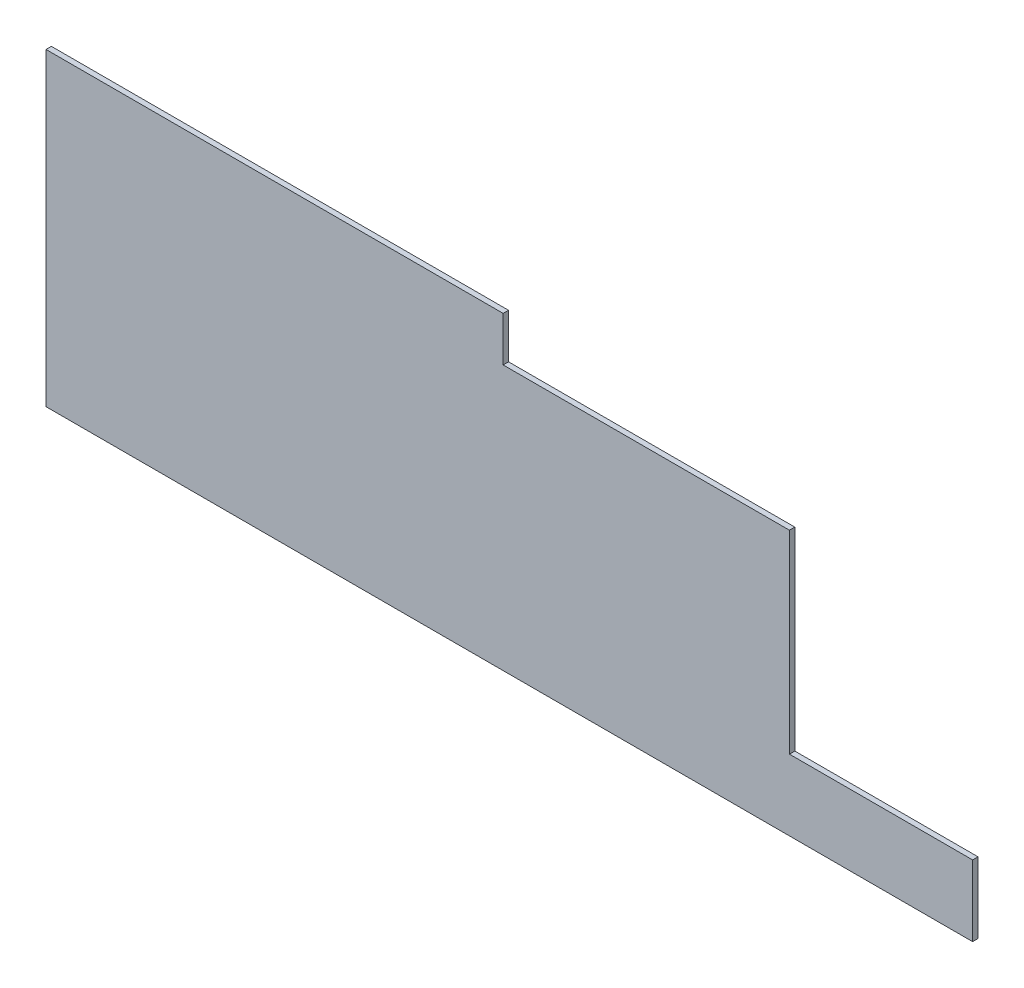
ISO-10303-21;
HEADER;
FILE_DESCRIPTION(('STEP AP214'),'2;1');
FILE_NAME('part.step','',(''),(''),'','','');
FILE_SCHEMA(('AUTOMOTIVE_DESIGN { 1 0 10303 214 1 1 1 1 }'));
ENDSEC;
DATA;
#1=APPLICATION_CONTEXT('core data for automotive mechanical design processes');
#2=APPLICATION_PROTOCOL_DEFINITION('international standard','automotive_design',2000,#1);
#3=PRODUCT_CONTEXT('',#1,'mechanical');
#4=PRODUCT('Part','Part','',(#3));
#5=PRODUCT_RELATED_PRODUCT_CATEGORY('part','',(#4));
#6=PRODUCT_DEFINITION_FORMATION('','',#4);
#7=PRODUCT_DEFINITION_CONTEXT('part definition',#1,'design');
#8=PRODUCT_DEFINITION('design','',#6,#7);
#9=PRODUCT_DEFINITION_SHAPE('','',#8);
#10=(LENGTH_UNIT() NAMED_UNIT(*) SI_UNIT(.MILLI.,.METRE.));
#11=(NAMED_UNIT(*) PLANE_ANGLE_UNIT() SI_UNIT($,.RADIAN.));
#12=(NAMED_UNIT(*) SI_UNIT($,.STERADIAN.) SOLID_ANGLE_UNIT());
#13=UNCERTAINTY_MEASURE_WITH_UNIT(LENGTH_MEASURE(1.E-05),#10,'distance_accuracy_value','');
#14=(GEOMETRIC_REPRESENTATION_CONTEXT(3) GLOBAL_UNCERTAINTY_ASSIGNED_CONTEXT((#13)) GLOBAL_UNIT_ASSIGNED_CONTEXT((#10,
#11,#12)) REPRESENTATION_CONTEXT('',''));
#15=CARTESIAN_POINT('',(0.,0.,0.));
#16=DIRECTION('',(0.,0.,1.));
#17=DIRECTION('',(1.,0.,0.));
#18=AXIS2_PLACEMENT_3D('',#15,#16,#17);
#19=CARTESIAN_POINT('',(-6020.,0.,-35.));
#20=DIRECTION('',(0.,-1.,0.));
#21=DIRECTION('',(0.,0.,-1.));
#22=AXIS2_PLACEMENT_3D('',#19,#20,#21);
#23=PLANE('',#22);
#24=DIRECTION('',(1.,0.,0.));
#25=VECTOR('',#24,1.);
#26=CARTESIAN_POINT('',(-6020.,0.,0.));
#27=LINE('',#26,#25);
#28=CARTESIAN_POINT('',(-6020.,0.,0.));
#29=VERTEX_POINT('',#28);
#30=CARTESIAN_POINT('',(0.,0.,0.));
#31=VERTEX_POINT('',#30);
#32=EDGE_CURVE('E145',#29,#31,#27,.T.);
#33=ORIENTED_EDGE('',*,*,#32,.F.);
#34=DIRECTION('',(0.,0.,1.));
#35=VECTOR('',#34,1.);
#36=CARTESIAN_POINT('',(-6020.,0.,-35.));
#37=LINE('',#36,#35);
#38=CARTESIAN_POINT('',(-6020.,0.,-35.));
#39=VERTEX_POINT('',#38);
#40=EDGE_CURVE('E61',#39,#29,#37,.T.);
#41=ORIENTED_EDGE('',*,*,#40,.F.);
#42=DIRECTION('',(1.,0.,0.));
#43=VECTOR('',#42,1.);
#44=CARTESIAN_POINT('',(-6020.,0.,-35.));
#45=LINE('',#44,#43);
#46=CARTESIAN_POINT('',(0.,0.,-35.));
#47=VERTEX_POINT('',#46);
#48=EDGE_CURVE('E140',#39,#47,#45,.T.);
#49=ORIENTED_EDGE('',*,*,#48,.T.);
#50=DIRECTION('',(0.,0.,1.));
#51=VECTOR('',#50,1.);
#52=CARTESIAN_POINT('',(0.,0.,-35.));
#53=LINE('',#52,#51);
#54=EDGE_CURVE('E82',#47,#31,#53,.T.);
#55=ORIENTED_EDGE('',*,*,#54,.T.);
#56=EDGE_LOOP('',(#33,#41,#49,#55));
#57=FACE_BOUND('',#56,.T.);
#58=ADVANCED_FACE('F38',(#57),#23,.T.);
#59=CARTESIAN_POINT('',(-6020.,2010.,-35.));
#60=DIRECTION('',(-1.,0.,0.));
#61=DIRECTION('',(0.,0.,1.));
#62=AXIS2_PLACEMENT_3D('',#59,#60,#61);
#63=PLANE('',#62);
#64=DIRECTION('',(0.,-1.,0.));
#65=VECTOR('',#64,1.);
#66=CARTESIAN_POINT('',(-6020.,2010.,0.));
#67=LINE('',#66,#65);
#68=CARTESIAN_POINT('',(-6020.,2010.,0.));
#69=VERTEX_POINT('',#68);
#70=EDGE_CURVE('E155',#69,#29,#67,.T.);
#71=ORIENTED_EDGE('',*,*,#70,.F.);
#72=DIRECTION('',(0.,0.,1.));
#73=VECTOR('',#72,1.);
#74=CARTESIAN_POINT('',(-6020.,2010.,-35.));
#75=LINE('',#74,#73);
#76=CARTESIAN_POINT('',(-6020.,2010.,-35.));
#77=VERTEX_POINT('',#76);
#78=EDGE_CURVE('E160',#77,#69,#75,.T.);
#79=ORIENTED_EDGE('',*,*,#78,.F.);
#80=DIRECTION('',(0.,-1.,0.));
#81=VECTOR('',#80,1.);
#82=CARTESIAN_POINT('',(-6020.,2010.,-35.));
#83=LINE('',#82,#81);
#84=EDGE_CURVE('E138',#77,#39,#83,.T.);
#85=ORIENTED_EDGE('',*,*,#84,.T.);
#86=ORIENTED_EDGE('',*,*,#40,.T.);
#87=EDGE_LOOP('',(#71,#79,#85,#86));
#88=FACE_BOUND('',#87,.T.);
#89=ADVANCED_FACE('F177',(#88),#63,.T.);
#90=CARTESIAN_POINT('',(-6020.,2010.,-35.));
#91=DIRECTION('',(0.,1.,0.));
#92=DIRECTION('',(0.,0.,1.));
#93=AXIS2_PLACEMENT_3D('',#90,#91,#92);
#94=PLANE('',#93);
#95=DIRECTION('',(0.,0.,1.));
#96=VECTOR('',#95,1.);
#97=CARTESIAN_POINT('',(-3050.,2010.,-35.));
#98=LINE('',#97,#96);
#99=CARTESIAN_POINT('',(-3050.,2010.,-35.));
#100=VERTEX_POINT('',#99);
#101=CARTESIAN_POINT('',(-3050.,2010.,0.));
#102=VERTEX_POINT('',#101);
#103=EDGE_CURVE('E52',#100,#102,#98,.T.);
#104=ORIENTED_EDGE('',*,*,#103,.F.);
#105=DIRECTION('',(-1.,0.,0.));
#106=VECTOR('',#105,1.);
#107=CARTESIAN_POINT('',(-6020.,2010.,-35.));
#108=LINE('',#107,#106);
#109=EDGE_CURVE('E135',#100,#77,#108,.T.);
#110=ORIENTED_EDGE('',*,*,#109,.T.);
#111=ORIENTED_EDGE('',*,*,#78,.T.);
#112=DIRECTION('',(-1.,0.,0.));
#113=VECTOR('',#112,1.);
#114=CARTESIAN_POINT('',(-6020.,2010.,0.));
#115=LINE('',#114,#113);
#116=EDGE_CURVE('E153',#102,#69,#115,.T.);
#117=ORIENTED_EDGE('',*,*,#116,.F.);
#118=EDGE_LOOP('',(#104,#110,#111,#117));
#119=FACE_BOUND('',#118,.T.);
#120=ADVANCED_FACE('F179',(#119),#94,.T.);
#121=CARTESIAN_POINT('',(-3045.,1720.,-35.));
#122=DIRECTION('',(0.,1.,0.));
#123=DIRECTION('',(0.,0.,1.));
#124=AXIS2_PLACEMENT_3D('',#121,#122,#123);
#125=PLANE('',#124);
#126=DIRECTION('',(0.,0.,1.));
#127=VECTOR('',#126,1.);
#128=CARTESIAN_POINT('',(-1190.,1720.,-35.));
#129=LINE('',#128,#127);
#130=CARTESIAN_POINT('',(-1190.,1720.,-35.));
#131=VERTEX_POINT('',#130);
#132=CARTESIAN_POINT('',(-1190.,1720.,0.));
#133=VERTEX_POINT('',#132);
#134=EDGE_CURVE('E115',#131,#133,#129,.T.);
#135=ORIENTED_EDGE('',*,*,#134,.F.);
#136=DIRECTION('',(-1.,0.,0.));
#137=VECTOR('',#136,1.);
#138=CARTESIAN_POINT('',(-3045.,1720.,-35.));
#139=LINE('',#138,#137);
#140=CARTESIAN_POINT('',(-3050.,1720.,-35.));
#141=VERTEX_POINT('',#140);
#142=EDGE_CURVE('E127',#131,#141,#139,.T.);
#143=ORIENTED_EDGE('',*,*,#142,.T.);
#144=DIRECTION('',(0.,0.,1.));
#145=VECTOR('',#144,1.);
#146=CARTESIAN_POINT('',(-3050.,1720.,-35.));
#147=LINE('',#146,#145);
#148=CARTESIAN_POINT('',(-3050.,1720.,0.));
#149=VERTEX_POINT('',#148);
#150=EDGE_CURVE('E165',#141,#149,#147,.T.);
#151=ORIENTED_EDGE('',*,*,#150,.T.);
#152=DIRECTION('',(-1.,0.,0.));
#153=VECTOR('',#152,1.);
#154=CARTESIAN_POINT('',(-3045.,1720.,0.));
#155=LINE('',#154,#153);
#156=EDGE_CURVE('E129',#133,#149,#155,.T.);
#157=ORIENTED_EDGE('',*,*,#156,.F.);
#158=EDGE_LOOP('',(#135,#143,#151,#157));
#159=FACE_BOUND('',#158,.T.);
#160=ADVANCED_FACE('F125',(#159),#125,.T.);
#161=CARTESIAN_POINT('',(0.,0.,-35.));
#162=DIRECTION('',(1.,0.,0.));
#163=DIRECTION('',(0.,0.,-1.));
#164=AXIS2_PLACEMENT_3D('',#161,#162,#163);
#165=PLANE('',#164);
#166=DIRECTION('',(0.,0.,1.));
#167=VECTOR('',#166,1.);
#168=CARTESIAN_POINT('',(1.73930922788498E-13,460.,-35.));
#169=LINE('',#168,#167);
#170=CARTESIAN_POINT('',(1.73930922788498E-13,460.,-35.));
#171=VERTEX_POINT('',#170);
#172=CARTESIAN_POINT('',(1.73930922788498E-13,460.,0.));
#173=VERTEX_POINT('',#172);
#174=EDGE_CURVE('E149',#171,#173,#169,.T.);
#175=ORIENTED_EDGE('',*,*,#174,.T.);
#176=DIRECTION('',(0.,1.,0.));
#177=VECTOR('',#176,1.);
#178=CARTESIAN_POINT('',(0.,0.,0.));
#179=LINE('',#178,#177);
#180=EDGE_CURVE('E148',#31,#173,#179,.T.);
#181=ORIENTED_EDGE('',*,*,#180,.F.);
#182=ORIENTED_EDGE('',*,*,#54,.F.);
#183=DIRECTION('',(0.,1.,0.));
#184=VECTOR('',#183,1.);
#185=CARTESIAN_POINT('',(0.,0.,-35.));
#186=LINE('',#185,#184);
#187=EDGE_CURVE('E136',#47,#171,#186,.T.);
#188=ORIENTED_EDGE('',*,*,#187,.T.);
#189=EDGE_LOOP('',(#175,#181,#182,#188));
#190=FACE_BOUND('',#189,.T.);
#191=ADVANCED_FACE('F181',(#190),#165,.T.);
#192=CARTESIAN_POINT('',(0.,0.,-35.));
#193=DIRECTION('',(0.,0.,1.));
#194=DIRECTION('',(1.,0.,0.));
#195=AXIS2_PLACEMENT_3D('',#192,#193,#194);
#196=PLANE('',#195);
#197=DIRECTION('',(0.,-1.,0.));
#198=VECTOR('',#197,1.);
#199=CARTESIAN_POINT('',(-1190.,1720.,-35.));
#200=LINE('',#199,#198);
#201=CARTESIAN_POINT('',(-1190.,460.,-35.));
#202=VERTEX_POINT('',#201);
#203=EDGE_CURVE('E112',#131,#202,#200,.T.);
#204=ORIENTED_EDGE('',*,*,#203,.T.);
#205=DIRECTION('',(1.,0.,0.));
#206=VECTOR('',#205,1.);
#207=CARTESIAN_POINT('',(1.73930922788498E-13,460.,-35.));
#208=LINE('',#207,#206);
#209=EDGE_CURVE('E168',#202,#171,#208,.T.);
#210=ORIENTED_EDGE('',*,*,#209,.T.);
#211=ORIENTED_EDGE('',*,*,#187,.F.);
#212=ORIENTED_EDGE('',*,*,#48,.F.);
#213=ORIENTED_EDGE('',*,*,#84,.F.);
#214=ORIENTED_EDGE('',*,*,#109,.F.);
#215=DIRECTION('',(0.,-1.,0.));
#216=VECTOR('',#215,1.);
#217=CARTESIAN_POINT('',(-3050.,2010.,-35.));
#218=LINE('',#217,#216);
#219=EDGE_CURVE('E134',#100,#141,#218,.T.);
#220=ORIENTED_EDGE('',*,*,#219,.T.);
#221=ORIENTED_EDGE('',*,*,#142,.F.);
#222=EDGE_LOOP('',(#204,#210,#211,#212,#213,#214,#220,#221));
#223=FACE_BOUND('',#222,.T.);
#224=ADVANCED_FACE('F132',(#223),#196,.F.);
#225=CARTESIAN_POINT('',(0.,0.,0.));
#226=DIRECTION('',(0.,0.,1.));
#227=DIRECTION('',(1.,0.,0.));
#228=AXIS2_PLACEMENT_3D('',#225,#226,#227);
#229=PLANE('',#228);
#230=DIRECTION('',(1.,0.,0.));
#231=VECTOR('',#230,1.);
#232=CARTESIAN_POINT('',(-1.41861830924326E-13,460.,0.));
#233=LINE('',#232,#231);
#234=CARTESIAN_POINT('',(-1190.,460.,0.));
#235=VERTEX_POINT('',#234);
#236=EDGE_CURVE('E159',#235,#173,#233,.T.);
#237=ORIENTED_EDGE('',*,*,#236,.F.);
#238=DIRECTION('',(0.,-1.,0.));
#239=VECTOR('',#238,1.);
#240=CARTESIAN_POINT('',(-1190.,-2.09708793540307E-13,0.));
#241=LINE('',#240,#239);
#242=EDGE_CURVE('E11',#133,#235,#241,.T.);
#243=ORIENTED_EDGE('',*,*,#242,.F.);
#244=ORIENTED_EDGE('',*,*,#156,.T.);
#245=DIRECTION('',(0.,-1.,0.));
#246=VECTOR('',#245,1.);
#247=CARTESIAN_POINT('',(-3050.,0.,0.));
#248=LINE('',#247,#246);
#249=EDGE_CURVE('E45',#102,#149,#248,.T.);
#250=ORIENTED_EDGE('',*,*,#249,.F.);
#251=ORIENTED_EDGE('',*,*,#116,.T.);
#252=ORIENTED_EDGE('',*,*,#70,.T.);
#253=ORIENTED_EDGE('',*,*,#32,.T.);
#254=ORIENTED_EDGE('',*,*,#180,.T.);
#255=EDGE_LOOP('',(#237,#243,#244,#250,#251,#252,#253,#254));
#256=FACE_BOUND('',#255,.T.);
#257=ADVANCED_FACE('F180',(#256),#229,.T.);
#258=CARTESIAN_POINT('',(1.73930922788498E-13,460.,-35.));
#259=DIRECTION('',(0.,-1.,0.));
#260=DIRECTION('',(1.,0.,0.));
#261=AXIS2_PLACEMENT_3D('',#258,#259,#260);
#262=PLANE('',#261);
#263=ORIENTED_EDGE('',*,*,#236,.T.);
#264=ORIENTED_EDGE('',*,*,#174,.F.);
#265=ORIENTED_EDGE('',*,*,#209,.F.);
#266=DIRECTION('',(0.,0.,1.));
#267=VECTOR('',#266,1.);
#268=CARTESIAN_POINT('',(-1190.,460.,-35.));
#269=LINE('',#268,#267);
#270=EDGE_CURVE('E118',#202,#235,#269,.T.);
#271=ORIENTED_EDGE('',*,*,#270,.T.);
#272=EDGE_LOOP('',(#263,#264,#265,#271));
#273=FACE_BOUND('',#272,.T.);
#274=ADVANCED_FACE('F183',(#273),#262,.F.);
#275=CARTESIAN_POINT('',(-3050.,2010.,-35.));
#276=DIRECTION('',(-1.,0.,0.));
#277=DIRECTION('',(0.,0.,1.));
#278=AXIS2_PLACEMENT_3D('',#275,#276,#277);
#279=PLANE('',#278);
#280=ORIENTED_EDGE('',*,*,#249,.T.);
#281=ORIENTED_EDGE('',*,*,#150,.F.);
#282=ORIENTED_EDGE('',*,*,#219,.F.);
#283=ORIENTED_EDGE('',*,*,#103,.T.);
#284=EDGE_LOOP('',(#280,#281,#282,#283));
#285=FACE_BOUND('',#284,.T.);
#286=ADVANCED_FACE('F164',(#285),#279,.F.);
#287=CARTESIAN_POINT('',(-1190.,1720.,-35.));
#288=DIRECTION('',(-1.,0.,0.));
#289=DIRECTION('',(0.,-1.,0.));
#290=AXIS2_PLACEMENT_3D('',#287,#288,#289);
#291=PLANE('',#290);
#292=ORIENTED_EDGE('',*,*,#242,.T.);
#293=ORIENTED_EDGE('',*,*,#270,.F.);
#294=ORIENTED_EDGE('',*,*,#203,.F.);
#295=ORIENTED_EDGE('',*,*,#134,.T.);
#296=EDGE_LOOP('',(#292,#293,#294,#295));
#297=FACE_BOUND('',#296,.T.);
#298=ADVANCED_FACE('F114',(#297),#291,.F.);
#299=CLOSED_SHELL('',(#58,#89,#120,#160,#191,#224,#257,#274,#286,#298));
#300=MANIFOLD_SOLID_BREP('B2',#299);
#301=ADVANCED_BREP_SHAPE_REPRESENTATION('',(#18,#300),#14);
#302=SHAPE_DEFINITION_REPRESENTATION(#9,#301);
ENDSEC;
END-ISO-10303-21;
